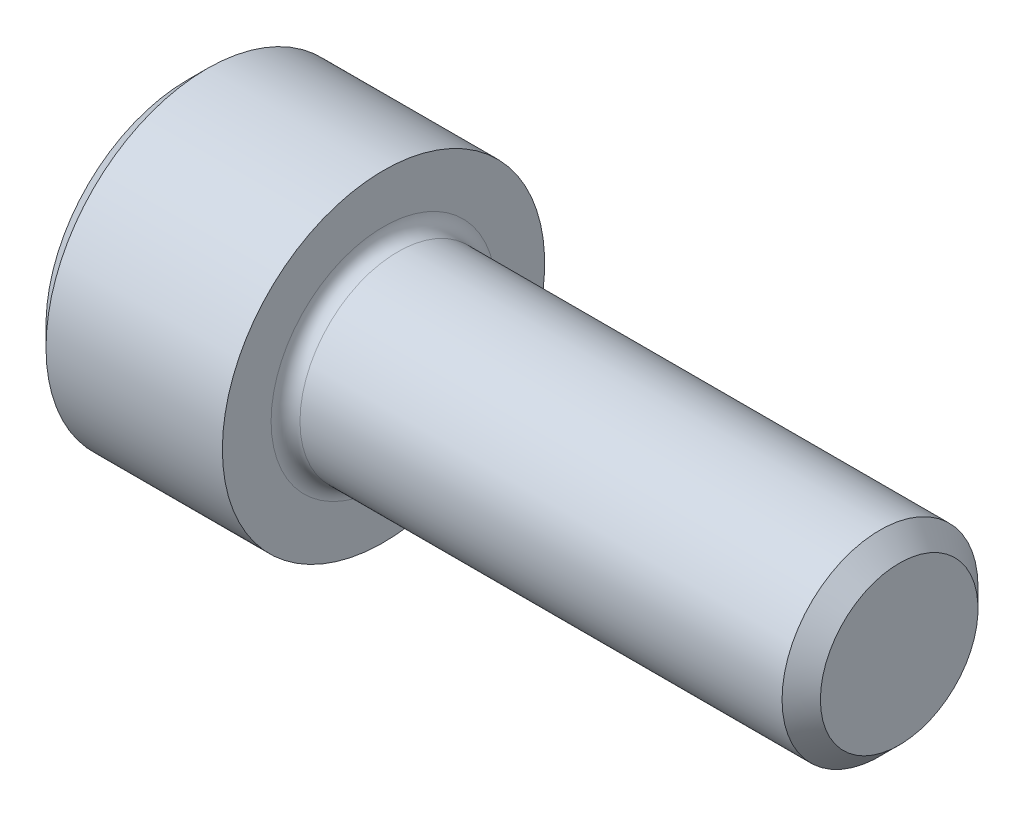
ISO-10303-21;
HEADER;
FILE_DESCRIPTION(('STEP AP214'),'2;1');
FILE_NAME('part.step','',(''),(''),'','','');
FILE_SCHEMA(('AUTOMOTIVE_DESIGN { 1 0 10303 214 1 1 1 1 }'));
ENDSEC;
DATA;
#1=APPLICATION_CONTEXT('core data for automotive mechanical design processes');
#2=APPLICATION_PROTOCOL_DEFINITION('international standard','automotive_design',2000,#1);
#3=PRODUCT_CONTEXT('',#1,'mechanical');
#4=PRODUCT('Part','Part','',(#3));
#5=PRODUCT_RELATED_PRODUCT_CATEGORY('part','',(#4));
#6=PRODUCT_DEFINITION_FORMATION('','',#4);
#7=PRODUCT_DEFINITION_CONTEXT('part definition',#1,'design');
#8=PRODUCT_DEFINITION('design','',#6,#7);
#9=PRODUCT_DEFINITION_SHAPE('','',#8);
#10=(LENGTH_UNIT() NAMED_UNIT(*) SI_UNIT(.MILLI.,.METRE.));
#11=(NAMED_UNIT(*) PLANE_ANGLE_UNIT() SI_UNIT($,.RADIAN.));
#12=(NAMED_UNIT(*) SI_UNIT($,.STERADIAN.) SOLID_ANGLE_UNIT());
#13=UNCERTAINTY_MEASURE_WITH_UNIT(LENGTH_MEASURE(1.E-05),#10,'distance_accuracy_value','');
#14=(GEOMETRIC_REPRESENTATION_CONTEXT(3) GLOBAL_UNCERTAINTY_ASSIGNED_CONTEXT((#13)) GLOBAL_UNIT_ASSIGNED_CONTEXT((#10,
#11,#12)) REPRESENTATION_CONTEXT('',''));
#15=CARTESIAN_POINT('',(0.,0.,0.));
#16=DIRECTION('',(0.,0.,1.));
#17=DIRECTION('',(1.,0.,0.));
#18=AXIS2_PLACEMENT_3D('',#15,#16,#17);
#19=CARTESIAN_POINT('',(2.286,1.14604605784411,1.98501));
#20=DIRECTION('',(-1.,0.,0.));
#21=DIRECTION('',(0.,0.,1.));
#22=AXIS2_PLACEMENT_3D('',#19,#20,#21);
#23=PLANE('',#22);
#24=DIRECTION('',(0.,0.500000000000001,0.866025403784438));
#25=VECTOR('',#24,1.);
#26=CARTESIAN_POINT('',(2.286,-1.71906908676614,0.992505));
#27=LINE('',#26,#25);
#28=CARTESIAN_POINT('',(2.2859999999804,-1.71906908679011,0.992505000013839));
#29=VERTEX_POINT('',#28);
#30=CARTESIAN_POINT('',(2.286,-1.14604605784409,1.98501));
#31=VERTEX_POINT('',#30);
#32=EDGE_CURVE('E100',#29,#31,#27,.T.);
#33=ORIENTED_EDGE('',*,*,#32,.T.);
#34=DIRECTION('',(0.,1.,0.));
#35=VECTOR('',#34,1.);
#36=CARTESIAN_POINT('',(2.286,1.14604605784411,1.98501));
#37=LINE('',#36,#35);
#38=CARTESIAN_POINT('',(2.28599999998701,0.,1.98501000001309));
#39=VERTEX_POINT('',#38);
#40=EDGE_CURVE('E95',#31,#39,#37,.T.);
#41=ORIENTED_EDGE('',*,*,#40,.T.);
#42=CARTESIAN_POINT('',(2.2859999999608,0.,0.));
#43=DIRECTION('',(-1.,0.,0.));
#44=DIRECTION('',(0.,0.,1.));
#45=AXIS2_PLACEMENT_3D('',#42,#43,#44);
#46=CIRCLE('',#45,1.98501000005535);
#47=EDGE_CURVE('E97',#39,#29,#46,.F.);
#48=ORIENTED_EDGE('',*,*,#47,.T.);
#49=EDGE_LOOP('',(#33,#41,#48));
#50=FACE_BOUND('',#49,.T.);
#51=ADVANCED_FACE('F16',(#50),#23,.T.);
#52=CARTESIAN_POINT('',(2.286,1.14604605784411,1.98501));
#53=DIRECTION('',(-1.,0.,0.));
#54=DIRECTION('',(0.,0.,1.));
#55=AXIS2_PLACEMENT_3D('',#52,#53,#54);
#56=PLANE('',#55);
#57=DIRECTION('',(0.,-0.499999999999999,0.86602540378444));
#58=VECTOR('',#57,1.);
#59=CARTESIAN_POINT('',(2.286,-1.71906908676615,-0.992504999999996));
#60=LINE('',#59,#58);
#61=CARTESIAN_POINT('',(2.2859999999804,-1.71906908679012,-0.992505000013836));
#62=VERTEX_POINT('',#61);
#63=CARTESIAN_POINT('',(2.286,-2.29209211568819,0.));
#64=VERTEX_POINT('',#63);
#65=EDGE_CURVE('E104',#62,#64,#60,.T.);
#66=ORIENTED_EDGE('',*,*,#65,.T.);
#67=DIRECTION('',(0.,0.500000000000001,0.866025403784438));
#68=VECTOR('',#67,1.);
#69=CARTESIAN_POINT('',(2.286,-2.29209211568819,0.));
#70=LINE('',#69,#68);
#71=EDGE_CURVE('E171',#64,#29,#70,.T.);
#72=ORIENTED_EDGE('',*,*,#71,.T.);
#73=CARTESIAN_POINT('',(2.2859999999608,0.,0.));
#74=DIRECTION('',(-1.,0.,0.));
#75=DIRECTION('',(0.,0.,1.));
#76=AXIS2_PLACEMENT_3D('',#73,#74,#75);
#77=CIRCLE('',#76,1.98501000005535);
#78=EDGE_CURVE('E116',#29,#62,#77,.F.);
#79=ORIENTED_EDGE('',*,*,#78,.T.);
#80=EDGE_LOOP('',(#66,#72,#79));
#81=FACE_BOUND('',#80,.T.);
#82=ADVANCED_FACE('F347',(#81),#56,.T.);
#83=CARTESIAN_POINT('',(2.286,1.14604605784411,1.98501));
#84=DIRECTION('',(-1.,0.,0.));
#85=DIRECTION('',(0.,0.,1.));
#86=AXIS2_PLACEMENT_3D('',#83,#84,#85);
#87=PLANE('',#86);
#88=DIRECTION('',(0.,1.,0.));
#89=VECTOR('',#88,1.);
#90=CARTESIAN_POINT('',(2.286,1.14604605784411,-1.98501));
#91=LINE('',#90,#89);
#92=CARTESIAN_POINT('',(2.28599999998701,0.,-1.98501000001309));
#93=VERTEX_POINT('',#92);
#94=CARTESIAN_POINT('',(2.286,-1.1460460578441,-1.98501));
#95=VERTEX_POINT('',#94);
#96=EDGE_CURVE('E166',#93,#95,#91,.F.);
#97=ORIENTED_EDGE('',*,*,#96,.T.);
#98=DIRECTION('',(0.,-0.499999999999999,0.866025403784439));
#99=VECTOR('',#98,1.);
#100=CARTESIAN_POINT('',(2.286,-1.1460460578441,-1.98501));
#101=LINE('',#100,#99);
#102=EDGE_CURVE('E161',#95,#62,#101,.T.);
#103=ORIENTED_EDGE('',*,*,#102,.T.);
#104=CARTESIAN_POINT('',(2.2859999999608,0.,0.));
#105=DIRECTION('',(-1.,0.,0.));
#106=DIRECTION('',(0.,0.,1.));
#107=AXIS2_PLACEMENT_3D('',#104,#105,#106);
#108=CIRCLE('',#107,1.98501000005535);
#109=EDGE_CURVE('E224',#62,#93,#108,.F.);
#110=ORIENTED_EDGE('',*,*,#109,.T.);
#111=EDGE_LOOP('',(#97,#103,#110));
#112=FACE_BOUND('',#111,.T.);
#113=ADVANCED_FACE('F344',(#112),#87,.T.);
#114=CARTESIAN_POINT('',(2.286,1.14604605784411,1.98501));
#115=DIRECTION('',(-1.,0.,0.));
#116=DIRECTION('',(0.,0.,1.));
#117=AXIS2_PLACEMENT_3D('',#114,#115,#116);
#118=PLANE('',#117);
#119=DIRECTION('',(0.,-0.500000000000001,-0.866025403784438));
#120=VECTOR('',#119,1.);
#121=CARTESIAN_POINT('',(2.286,1.71906908676615,-0.992505000000006));
#122=LINE('',#121,#120);
#123=CARTESIAN_POINT('',(2.2859999999804,1.71906908679012,-0.992505000013843));
#124=VERTEX_POINT('',#123);
#125=CARTESIAN_POINT('',(2.286,1.1460460578441,-1.98501));
#126=VERTEX_POINT('',#125);
#127=EDGE_CURVE('E156',#124,#126,#122,.T.);
#128=ORIENTED_EDGE('',*,*,#127,.T.);
#129=DIRECTION('',(0.,1.,0.));
#130=VECTOR('',#129,1.);
#131=CARTESIAN_POINT('',(2.286,1.14604605784411,-1.98501));
#132=LINE('',#131,#130);
#133=EDGE_CURVE('E151',#126,#93,#132,.F.);
#134=ORIENTED_EDGE('',*,*,#133,.T.);
#135=CARTESIAN_POINT('',(2.2859999999608,0.,0.));
#136=DIRECTION('',(-1.,0.,0.));
#137=DIRECTION('',(0.,0.,1.));
#138=AXIS2_PLACEMENT_3D('',#135,#136,#137);
#139=CIRCLE('',#138,1.98501000005535);
#140=EDGE_CURVE('E221',#93,#124,#139,.F.);
#141=ORIENTED_EDGE('',*,*,#140,.T.);
#142=EDGE_LOOP('',(#128,#134,#141));
#143=FACE_BOUND('',#142,.T.);
#144=ADVANCED_FACE('F340',(#143),#118,.T.);
#145=CARTESIAN_POINT('',(2.286,1.14604605784411,1.98501));
#146=DIRECTION('',(-1.,0.,0.));
#147=DIRECTION('',(0.,0.,1.));
#148=AXIS2_PLACEMENT_3D('',#145,#146,#147);
#149=PLANE('',#148);
#150=DIRECTION('',(0.,0.500000000000002,-0.866025403784437));
#151=VECTOR('',#150,1.);
#152=CARTESIAN_POINT('',(2.286,1.71906908676615,0.992504999999996));
#153=LINE('',#152,#151);
#154=CARTESIAN_POINT('',(2.2859999999804,1.71906908679012,0.992505000013835));
#155=VERTEX_POINT('',#154);
#156=CARTESIAN_POINT('',(2.286,2.2920921156882,0.));
#157=VERTEX_POINT('',#156);
#158=EDGE_CURVE('E146',#155,#157,#153,.T.);
#159=ORIENTED_EDGE('',*,*,#158,.T.);
#160=DIRECTION('',(0.,-0.500000000000002,-0.866025403784437));
#161=VECTOR('',#160,1.);
#162=CARTESIAN_POINT('',(2.286,2.2920921156882,0.));
#163=LINE('',#162,#161);
#164=EDGE_CURVE('E117',#157,#124,#163,.T.);
#165=ORIENTED_EDGE('',*,*,#164,.T.);
#166=CARTESIAN_POINT('',(2.2859999999608,0.,0.));
#167=DIRECTION('',(-1.,0.,0.));
#168=DIRECTION('',(0.,0.,1.));
#169=AXIS2_PLACEMENT_3D('',#166,#167,#168);
#170=CIRCLE('',#169,1.98501000005535);
#171=EDGE_CURVE('E124',#124,#155,#170,.F.);
#172=ORIENTED_EDGE('',*,*,#171,.T.);
#173=EDGE_LOOP('',(#159,#165,#172));
#174=FACE_BOUND('',#173,.T.);
#175=ADVANCED_FACE('F336',(#174),#149,.T.);
#176=CARTESIAN_POINT('',(2.28600000002643,0.,0.));
#177=DIRECTION('',(-1.,0.,0.));
#178=DIRECTION('',(0.,0.,1.));
#179=AXIS2_PLACEMENT_3D('',#176,#177,#178);
#180=CONICAL_SURFACE('',#179,1.98500999994167,1.04719755112655);
#181=CARTESIAN_POINT('',(3.43204605781011,0.,5.6843418860808E-11));
#182=VERTEX_POINT('',#181);
#183=VERTEX_LOOP('',#182);
#184=FACE_BOUND('',#183,.T.);
#185=ORIENTED_EDGE('',*,*,#47,.F.);
#186=CARTESIAN_POINT('',(2.2859999999608,0.,0.));
#187=DIRECTION('',(-1.,0.,0.));
#188=DIRECTION('',(0.,0.,1.));
#189=AXIS2_PLACEMENT_3D('',#186,#187,#188);
#190=CIRCLE('',#189,1.98501000005535);
#191=EDGE_CURVE('E112',#155,#39,#190,.F.);
#192=ORIENTED_EDGE('',*,*,#191,.F.);
#193=ORIENTED_EDGE('',*,*,#171,.F.);
#194=ORIENTED_EDGE('',*,*,#140,.F.);
#195=ORIENTED_EDGE('',*,*,#109,.F.);
#196=ORIENTED_EDGE('',*,*,#78,.F.);
#197=EDGE_LOOP('',(#185,#192,#193,#194,#195,#196));
#198=FACE_BOUND('',#197,.T.);
#199=ADVANCED_FACE('F110',(#184,#198),#180,.F.);
#200=CARTESIAN_POINT('',(2.286,1.14604605784411,1.98501));
#201=DIRECTION('',(-1.,0.,0.));
#202=DIRECTION('',(0.,0.,1.));
#203=AXIS2_PLACEMENT_3D('',#200,#201,#202);
#204=PLANE('',#203);
#205=DIRECTION('',(0.,-1.,0.));
#206=VECTOR('',#205,1.);
#207=CARTESIAN_POINT('',(2.286,-1.14604605784409,1.98501));
#208=LINE('',#207,#206);
#209=CARTESIAN_POINT('',(2.286,1.14604605784411,1.98501));
#210=VERTEX_POINT('',#209);
#211=EDGE_CURVE('E121',#39,#210,#208,.F.);
#212=ORIENTED_EDGE('',*,*,#211,.T.);
#213=DIRECTION('',(0.,0.499999999999998,-0.86602540378444));
#214=VECTOR('',#213,1.);
#215=CARTESIAN_POINT('',(2.286,2.2920921156882,0.));
#216=LINE('',#215,#214);
#217=EDGE_CURVE('E123',#155,#210,#216,.F.);
#218=ORIENTED_EDGE('',*,*,#217,.F.);
#219=ORIENTED_EDGE('',*,*,#191,.T.);
#220=EDGE_LOOP('',(#212,#218,#219));
#221=FACE_BOUND('',#220,.T.);
#222=ADVANCED_FACE('F120',(#221),#204,.T.);
#223=CARTESIAN_POINT('',(2.286,2.2920921156882,0.));
#224=DIRECTION('',(0.,-0.86602540378444,-0.499999999999998));
#225=DIRECTION('',(0.,0.499999999999998,-0.86602540378444));
#226=AXIS2_PLACEMENT_3D('',#223,#224,#225);
#227=PLANE('',#226);
#228=ORIENTED_EDGE('',*,*,#217,.T.);
#229=DIRECTION('',(1.,0.,0.));
#230=VECTOR('',#229,1.);
#231=CARTESIAN_POINT('',(2.286,1.14604605784411,1.98501));
#232=LINE('',#231,#230);
#233=CARTESIAN_POINT('',(0.,1.14604605784411,1.98501));
#234=VERTEX_POINT('',#233);
#235=EDGE_CURVE('E129',#210,#234,#232,.F.);
#236=ORIENTED_EDGE('',*,*,#235,.T.);
#237=DIRECTION('',(0.,-0.499999999999998,0.86602540378444));
#238=VECTOR('',#237,1.);
#239=CARTESIAN_POINT('',(0.,2.2920921156882,0.));
#240=LINE('',#239,#238);
#241=CARTESIAN_POINT('',(0.,2.2920921156882,0.));
#242=VERTEX_POINT('',#241);
#243=EDGE_CURVE('E136',#242,#234,#240,.T.);
#244=ORIENTED_EDGE('',*,*,#243,.F.);
#245=DIRECTION('',(1.,0.,0.));
#246=VECTOR('',#245,1.);
#247=CARTESIAN_POINT('',(2.286,2.2920921156882,0.));
#248=LINE('',#247,#246);
#249=EDGE_CURVE('E186',#242,#157,#248,.T.);
#250=ORIENTED_EDGE('',*,*,#249,.T.);
#251=ORIENTED_EDGE('',*,*,#158,.F.);
#252=EDGE_LOOP('',(#228,#236,#244,#250,#251));
#253=FACE_BOUND('',#252,.T.);
#254=ADVANCED_FACE('F328',(#253),#227,.T.);
#255=CARTESIAN_POINT('',(2.286,-1.14604605784409,1.98501));
#256=DIRECTION('',(0.,0.,1.));
#257=DIRECTION('',(0.,-1.,0.));
#258=AXIS2_PLACEMENT_3D('',#255,#256,#257);
#259=PLANE('',#258);
#260=ORIENTED_EDGE('',*,*,#235,.F.);
#261=ORIENTED_EDGE('',*,*,#211,.F.);
#262=ORIENTED_EDGE('',*,*,#40,.F.);
#263=DIRECTION('',(1.,0.,0.));
#264=VECTOR('',#263,1.);
#265=CARTESIAN_POINT('',(2.286,-1.14604605784409,1.98501));
#266=LINE('',#265,#264);
#267=CARTESIAN_POINT('',(0.,-1.14604605784409,1.98501));
#268=VERTEX_POINT('',#267);
#269=EDGE_CURVE('E131',#268,#31,#266,.T.);
#270=ORIENTED_EDGE('',*,*,#269,.F.);
#271=DIRECTION('',(0.,1.,0.));
#272=VECTOR('',#271,1.);
#273=CARTESIAN_POINT('',(0.,0.,1.98501));
#274=LINE('',#273,#272);
#275=EDGE_CURVE('E363',#234,#268,#274,.F.);
#276=ORIENTED_EDGE('',*,*,#275,.F.);
#277=EDGE_LOOP('',(#260,#261,#262,#270,#276));
#278=FACE_BOUND('',#277,.T.);
#279=ADVANCED_FACE('F127',(#278),#259,.F.);
#280=CARTESIAN_POINT('',(2.286,-1.14604605784409,1.98501));
#281=DIRECTION('',(0.,0.866025403784438,-0.500000000000001));
#282=DIRECTION('',(0.,0.500000000000001,0.866025403784438));
#283=AXIS2_PLACEMENT_3D('',#280,#281,#282);
#284=PLANE('',#283);
#285=ORIENTED_EDGE('',*,*,#71,.F.);
#286=DIRECTION('',(1.,0.,0.));
#287=VECTOR('',#286,1.);
#288=CARTESIAN_POINT('',(2.286,-2.29209211568819,0.));
#289=LINE('',#288,#287);
#290=CARTESIAN_POINT('',(0.,-2.29209211568819,0.));
#291=VERTEX_POINT('',#290);
#292=EDGE_CURVE('E197',#291,#64,#289,.T.);
#293=ORIENTED_EDGE('',*,*,#292,.F.);
#294=DIRECTION('',(0.,-0.500000000000001,-0.866025403784438));
#295=VECTOR('',#294,1.);
#296=CARTESIAN_POINT('',(0.,-1.14604605784409,1.98501));
#297=LINE('',#296,#295);
#298=EDGE_CURVE('E361',#268,#291,#297,.T.);
#299=ORIENTED_EDGE('',*,*,#298,.F.);
#300=ORIENTED_EDGE('',*,*,#269,.T.);
#301=ORIENTED_EDGE('',*,*,#32,.F.);
#302=EDGE_LOOP('',(#285,#293,#299,#300,#301));
#303=FACE_BOUND('',#302,.T.);
#304=ADVANCED_FACE('F321',(#303),#284,.T.);
#305=CARTESIAN_POINT('',(2.286,-2.29209211568819,0.));
#306=DIRECTION('',(0.,0.866025403784439,0.499999999999999));
#307=DIRECTION('',(0.,-0.499999999999999,0.866025403784439));
#308=AXIS2_PLACEMENT_3D('',#305,#306,#307);
#309=PLANE('',#308);
#310=ORIENTED_EDGE('',*,*,#102,.F.);
#311=DIRECTION('',(1.,0.,0.));
#312=VECTOR('',#311,1.);
#313=CARTESIAN_POINT('',(2.286,-1.1460460578441,-1.98501));
#314=LINE('',#313,#312);
#315=CARTESIAN_POINT('',(0.,-1.1460460578441,-1.98501));
#316=VERTEX_POINT('',#315);
#317=EDGE_CURVE('E190',#95,#316,#314,.F.);
#318=ORIENTED_EDGE('',*,*,#317,.T.);
#319=DIRECTION('',(0.,0.499999999999999,-0.866025403784439));
#320=VECTOR('',#319,1.);
#321=CARTESIAN_POINT('',(0.,-2.29209211568819,0.));
#322=LINE('',#321,#320);
#323=EDGE_CURVE('E358',#291,#316,#322,.T.);
#324=ORIENTED_EDGE('',*,*,#323,.F.);
#325=ORIENTED_EDGE('',*,*,#292,.T.);
#326=ORIENTED_EDGE('',*,*,#65,.F.);
#327=EDGE_LOOP('',(#310,#318,#324,#325,#326));
#328=FACE_BOUND('',#327,.T.);
#329=ADVANCED_FACE('F317',(#328),#309,.T.);
#330=CARTESIAN_POINT('',(2.286,1.1460460578441,-1.98501));
#331=DIRECTION('',(0.,0.,-1.));
#332=DIRECTION('',(0.,1.,0.));
#333=AXIS2_PLACEMENT_3D('',#330,#331,#332);
#334=PLANE('',#333);
#335=ORIENTED_EDGE('',*,*,#317,.F.);
#336=ORIENTED_EDGE('',*,*,#96,.F.);
#337=ORIENTED_EDGE('',*,*,#133,.F.);
#338=DIRECTION('',(1.,0.,0.));
#339=VECTOR('',#338,1.);
#340=CARTESIAN_POINT('',(2.286,1.1460460578441,-1.98501));
#341=LINE('',#340,#339);
#342=CARTESIAN_POINT('',(0.,1.1460460578441,-1.98501));
#343=VERTEX_POINT('',#342);
#344=EDGE_CURVE('E189',#126,#343,#341,.F.);
#345=ORIENTED_EDGE('',*,*,#344,.T.);
#346=DIRECTION('',(0.,1.,0.));
#347=VECTOR('',#346,1.);
#348=CARTESIAN_POINT('',(0.,0.,-1.98501));
#349=LINE('',#348,#347);
#350=EDGE_CURVE('E373',#316,#343,#349,.T.);
#351=ORIENTED_EDGE('',*,*,#350,.F.);
#352=EDGE_LOOP('',(#335,#336,#337,#345,#351));
#353=FACE_BOUND('',#352,.T.);
#354=ADVANCED_FACE('F313',(#353),#334,.F.);
#355=CARTESIAN_POINT('',(2.286,2.2920921156882,0.));
#356=DIRECTION('',(0.,0.866025403784438,-0.500000000000002));
#357=DIRECTION('',(0.,0.500000000000002,0.866025403784438));
#358=AXIS2_PLACEMENT_3D('',#355,#356,#357);
#359=PLANE('',#358);
#360=ORIENTED_EDGE('',*,*,#344,.F.);
#361=ORIENTED_EDGE('',*,*,#127,.F.);
#362=ORIENTED_EDGE('',*,*,#164,.F.);
#363=ORIENTED_EDGE('',*,*,#249,.F.);
#364=DIRECTION('',(0.,0.500000000000002,0.866025403784438));
#365=VECTOR('',#364,1.);
#366=CARTESIAN_POINT('',(0.,1.1460460578441,-1.98501));
#367=LINE('',#366,#365);
#368=EDGE_CURVE('E217',#343,#242,#367,.T.);
#369=ORIENTED_EDGE('',*,*,#368,.F.);
#370=EDGE_LOOP('',(#360,#361,#362,#363,#369));
#371=FACE_BOUND('',#370,.T.);
#372=ADVANCED_FACE('F309',(#371),#359,.F.);
#373=CARTESIAN_POINT('',(0.,0.,0.));
#374=DIRECTION('',(-1.,0.,0.));
#375=DIRECTION('',(0.,0.,1.));
#376=AXIS2_PLACEMENT_3D('',#373,#374,#375);
#377=PLANE('',#376);
#378=CARTESIAN_POINT('',(-5.68434730709166E-11,0.,0.));
#379=DIRECTION('',(1.,0.,0.));
#380=DIRECTION('',(0.,1.,0.));
#381=AXIS2_PLACEMENT_3D('',#378,#379,#380);
#382=CIRCLE('',#381,3.48615000001473);
#383=CARTESIAN_POINT('',(-5.68434968799963E-11,3.48615000001473,0.));
#384=VERTEX_POINT('',#383);
#385=EDGE_CURVE('E215',#384,#384,#382,.T.);
#386=ORIENTED_EDGE('',*,*,#385,.F.);
#387=EDGE_LOOP('',(#386));
#388=FACE_BOUND('',#387,.T.);
#389=ORIENTED_EDGE('',*,*,#350,.T.);
#390=ORIENTED_EDGE('',*,*,#368,.T.);
#391=ORIENTED_EDGE('',*,*,#243,.T.);
#392=ORIENTED_EDGE('',*,*,#275,.T.);
#393=ORIENTED_EDGE('',*,*,#298,.T.);
#394=ORIENTED_EDGE('',*,*,#323,.T.);
#395=EDGE_LOOP('',(#389,#390,#391,#392,#393,#394));
#396=FACE_BOUND('',#395,.T.);
#397=ADVANCED_FACE('F301',(#388,#396),#377,.T.);
#398=CARTESIAN_POINT('',(0.482599999998001,0.,0.));
#399=DIRECTION('',(1.,0.,0.));
#400=DIRECTION('',(0.,1.,0.));
#401=AXIS2_PLACEMENT_3D('',#398,#399,#400);
#402=CONICAL_SURFACE('',#401,3.96875000006958,0.785398163397448);
#403=ORIENTED_EDGE('',*,*,#385,.T.);
#404=EDGE_LOOP('',(#403));
#405=FACE_BOUND('',#404,.T.);
#406=CARTESIAN_POINT('',(0.4826,0.,0.));
#407=DIRECTION('',(-1.,0.,0.));
#408=DIRECTION('',(0.,0.,1.));
#409=AXIS2_PLACEMENT_3D('',#406,#407,#408);
#410=CIRCLE('',#409,3.96875);
#411=CARTESIAN_POINT('',(0.4826,0.,3.96875));
#412=VERTEX_POINT('',#411);
#413=EDGE_CURVE('E214',#412,#412,#410,.F.);
#414=ORIENTED_EDGE('',*,*,#413,.F.);
#415=EDGE_LOOP('',(#414));
#416=FACE_BOUND('',#415,.T.);
#417=ADVANCED_FACE('F296',(#405,#416),#402,.T.);
#418=CARTESIAN_POINT('',(-31.75,0.,0.));
#419=DIRECTION('',(-1.,0.,0.));
#420=DIRECTION('',(0.,0.,1.));
#421=AXIS2_PLACEMENT_3D('',#418,#419,#420);
#422=CYLINDRICAL_SURFACE('',#421,3.96875);
#423=CARTESIAN_POINT('',(4.826,0.,0.));
#424=DIRECTION('',(-1.,0.,0.));
#425=DIRECTION('',(0.,0.,1.));
#426=AXIS2_PLACEMENT_3D('',#423,#424,#425);
#427=CIRCLE('',#426,3.96875);
#428=CARTESIAN_POINT('',(4.826,0.,3.96875));
#429=VERTEX_POINT('',#428);
#430=EDGE_CURVE('E211',#429,#429,#427,.F.);
#431=ORIENTED_EDGE('',*,*,#430,.F.);
#432=EDGE_LOOP('',(#431));
#433=FACE_BOUND('',#432,.T.);
#434=ORIENTED_EDGE('',*,*,#413,.T.);
#435=EDGE_LOOP('',(#434));
#436=FACE_BOUND('',#435,.T.);
#437=ADVANCED_FACE('F292',(#433,#436),#422,.T.);
#438=CARTESIAN_POINT('',(17.526,1.94056,0.));
#439=DIRECTION('',(1.,0.,0.));
#440=DIRECTION('',(0.,0.,-1.));
#441=AXIS2_PLACEMENT_3D('',#438,#439,#440);
#442=PLANE('',#441);
#443=CARTESIAN_POINT('',(17.5259999999753,0.,0.));
#444=DIRECTION('',(-1.,0.,0.));
#445=DIRECTION('',(0.,0.,1.));
#446=AXIS2_PLACEMENT_3D('',#443,#444,#445);
#447=CIRCLE('',#446,1.94055999998);
#448=CARTESIAN_POINT('',(17.5259999999753,0.,1.94055999998));
#449=VERTEX_POINT('',#448);
#450=EDGE_CURVE('E207',#449,#449,#447,.T.);
#451=ORIENTED_EDGE('',*,*,#450,.F.);
#452=EDGE_LOOP('',(#451));
#453=FACE_BOUND('',#452,.T.);
#454=ADVANCED_FACE('F250',(#453),#442,.T.);
#455=CARTESIAN_POINT('',(4.826,3.96875,0.));
#456=DIRECTION('',(1.,0.,0.));
#457=DIRECTION('',(0.,0.,-1.));
#458=AXIS2_PLACEMENT_3D('',#455,#456,#457);
#459=PLANE('',#458);
#460=ORIENTED_EDGE('',*,*,#430,.T.);
#461=EDGE_LOOP('',(#460));
#462=FACE_BOUND('',#461,.T.);
#463=CARTESIAN_POINT('',(4.826,0.,0.));
#464=DIRECTION('',(1.,0.,0.));
#465=DIRECTION('',(0.,0.,1.));
#466=AXIS2_PLACEMENT_3D('',#463,#464,#465);
#467=CIRCLE('',#466,2.76859999999999);
#468=CARTESIAN_POINT('',(4.826,0.,-2.76859999999999));
#469=VERTEX_POINT('',#468);
#470=CARTESIAN_POINT('',(4.826,0.,2.76859999999999));
#471=VERTEX_POINT('',#470);
#472=EDGE_CURVE('E210',#469,#471,#467,.F.);
#473=ORIENTED_EDGE('',*,*,#472,.T.);
#474=CARTESIAN_POINT('',(4.826,0.,0.));
#475=DIRECTION('',(1.,0.,0.));
#476=DIRECTION('',(0.,0.,-1.));
#477=AXIS2_PLACEMENT_3D('',#474,#475,#476);
#478=CIRCLE('',#477,2.76859999999999);
#479=EDGE_CURVE('E35',#471,#469,#478,.F.);
#480=ORIENTED_EDGE('',*,*,#479,.T.);
#481=EDGE_LOOP('',(#473,#480));
#482=FACE_BOUND('',#481,.T.);
#483=ADVANCED_FACE('F231',(#462,#482),#459,.T.);
#484=CARTESIAN_POINT('',(17.0535599999084,0.,0.));
#485=DIRECTION('',(-1.,0.,0.));
#486=DIRECTION('',(0.,0.,1.));
#487=AXIS2_PLACEMENT_3D('',#484,#485,#486);
#488=CONICAL_SURFACE('',#487,2.41299999999001,0.785398163337289);
#489=CARTESIAN_POINT('',(17.05356,0.,0.));
#490=DIRECTION('',(-1.,0.,0.));
#491=DIRECTION('',(0.,0.,1.));
#492=AXIS2_PLACEMENT_3D('',#489,#490,#491);
#493=CIRCLE('',#492,2.41299999999999);
#494=CARTESIAN_POINT('',(17.05356,0.,2.41299999999999));
#495=VERTEX_POINT('',#494);
#496=EDGE_CURVE('E27',#495,#495,#493,.T.);
#497=ORIENTED_EDGE('',*,*,#496,.F.);
#498=EDGE_LOOP('',(#497));
#499=FACE_BOUND('',#498,.T.);
#500=ORIENTED_EDGE('',*,*,#450,.T.);
#501=EDGE_LOOP('',(#500));
#502=FACE_BOUND('',#501,.T.);
#503=ADVANCED_FACE('F249',(#499,#502),#488,.T.);
#504=CARTESIAN_POINT('',(5.1816,0.,0.));
#505=DIRECTION('',(1.,0.,0.));
#506=DIRECTION('',(0.,0.,-1.));
#507=AXIS2_PLACEMENT_3D('',#504,#505,#506);
#508=TOROIDAL_SURFACE('',#507,2.76859999999999,0.3556);
#509=CARTESIAN_POINT('',(5.1816,0.,0.));
#510=DIRECTION('',(-1.,0.,0.));
#511=DIRECTION('',(0.,0.,1.));
#512=AXIS2_PLACEMENT_3D('',#509,#510,#511);
#513=CIRCLE('',#512,2.41299999999999);
#514=CARTESIAN_POINT('',(5.1816,0.,2.41299999999999));
#515=VERTEX_POINT('',#514);
#516=EDGE_CURVE('E11',#515,#515,#513,.F.);
#517=ORIENTED_EDGE('',*,*,#516,.F.);
#518=EDGE_LOOP('',(#517));
#519=FACE_BOUND('',#518,.T.);
#520=ORIENTED_EDGE('',*,*,#472,.F.);
#521=ORIENTED_EDGE('',*,*,#479,.F.);
#522=EDGE_LOOP('',(#520,#521));
#523=FACE_BOUND('',#522,.T.);
#524=ADVANCED_FACE('F228',(#519,#523),#508,.F.);
#525=CARTESIAN_POINT('',(-31.75,0.,0.));
#526=DIRECTION('',(-1.,0.,0.));
#527=DIRECTION('',(0.,0.,1.));
#528=AXIS2_PLACEMENT_3D('',#525,#526,#527);
#529=CYLINDRICAL_SURFACE('',#528,2.41299999999999);
#530=ORIENTED_EDGE('',*,*,#516,.T.);
#531=EDGE_LOOP('',(#530));
#532=FACE_BOUND('',#531,.T.);
#533=ORIENTED_EDGE('',*,*,#496,.T.);
#534=EDGE_LOOP('',(#533));
#535=FACE_BOUND('',#534,.T.);
#536=ADVANCED_FACE('F274',(#532,#535),#529,.T.);
#537=CLOSED_SHELL('',(#51,#82,#113,#144,#175,#199,#222,#254,#279,#304,#329,#354,#372,#397,#417,
#437,#454,#483,#503,#524,#536));
#538=MANIFOLD_SOLID_BREP('B1',#537);
#539=ADVANCED_BREP_SHAPE_REPRESENTATION('',(#18,#538),#14);
#540=SHAPE_DEFINITION_REPRESENTATION(#9,#539);
ENDSEC;
END-ISO-10303-21;
